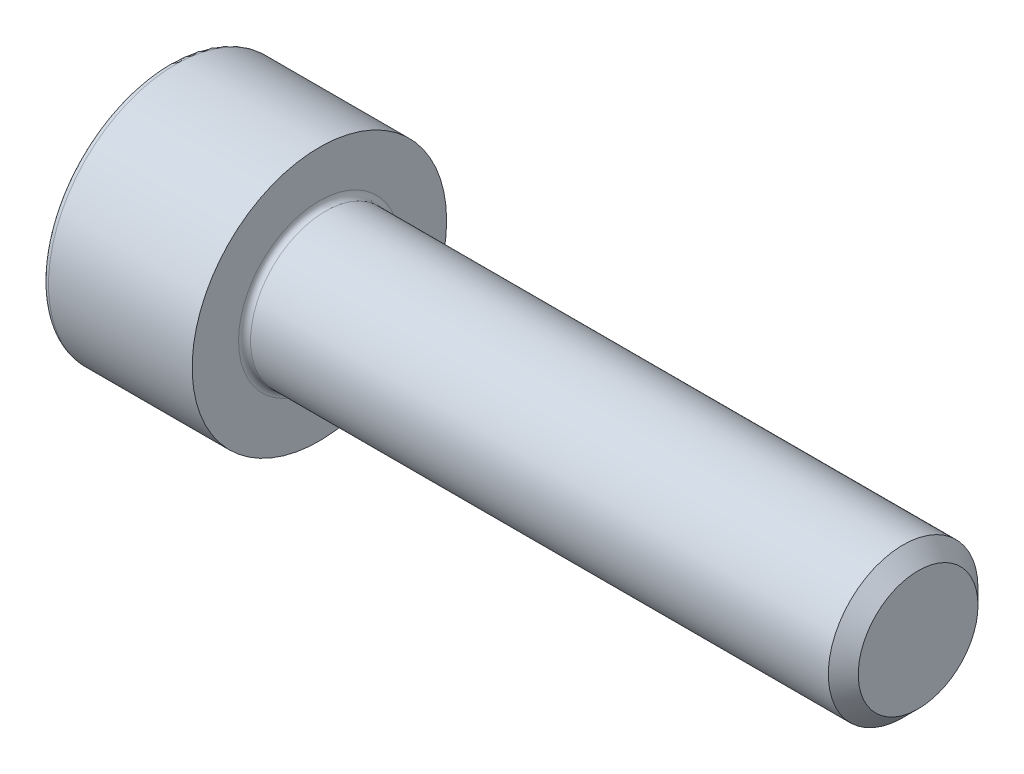
ISO-10303-21;
HEADER;
FILE_DESCRIPTION(('STEP AP214'),'2;1');
FILE_NAME('part.step','',(''),(''),'','','');
FILE_SCHEMA(('AUTOMOTIVE_DESIGN { 1 0 10303 214 1 1 1 1 }'));
ENDSEC;
DATA;
#1=APPLICATION_CONTEXT('core data for automotive mechanical design processes');
#2=APPLICATION_PROTOCOL_DEFINITION('international standard','automotive_design',2000,#1);
#3=PRODUCT_CONTEXT('',#1,'mechanical');
#4=PRODUCT('Part','Part','',(#3));
#5=PRODUCT_RELATED_PRODUCT_CATEGORY('part','',(#4));
#6=PRODUCT_DEFINITION_FORMATION('','',#4);
#7=PRODUCT_DEFINITION_CONTEXT('part definition',#1,'design');
#8=PRODUCT_DEFINITION('design','',#6,#7);
#9=PRODUCT_DEFINITION_SHAPE('','',#8);
#10=(LENGTH_UNIT() NAMED_UNIT(*) SI_UNIT(.MILLI.,.METRE.));
#11=(NAMED_UNIT(*) PLANE_ANGLE_UNIT() SI_UNIT($,.RADIAN.));
#12=(NAMED_UNIT(*) SI_UNIT($,.STERADIAN.) SOLID_ANGLE_UNIT());
#13=UNCERTAINTY_MEASURE_WITH_UNIT(LENGTH_MEASURE(1.E-05),#10,'distance_accuracy_value','');
#14=(GEOMETRIC_REPRESENTATION_CONTEXT(3) GLOBAL_UNCERTAINTY_ASSIGNED_CONTEXT((#13)) GLOBAL_UNIT_ASSIGNED_CONTEXT((#10,
#11,#12)) REPRESENTATION_CONTEXT('',''));
#15=CARTESIAN_POINT('',(0.,0.,0.));
#16=DIRECTION('',(0.,0.,1.));
#17=DIRECTION('',(1.,0.,0.));
#18=AXIS2_PLACEMENT_3D('',#15,#16,#17);
#19=CARTESIAN_POINT('',(0.,0.,0.));
#20=DIRECTION('',(1.,0.,0.));
#21=DIRECTION('',(0.,0.,-1.));
#22=AXIS2_PLACEMENT_3D('',#19,#20,#21);
#23=CYLINDRICAL_SURFACE('',#22,2.5);
#24=CARTESIAN_POINT('',(24.5,0.,0.));
#25=DIRECTION('',(1.,0.,0.));
#26=DIRECTION('',(0.,0.,-1.));
#27=AXIS2_PLACEMENT_3D('',#24,#25,#26);
#28=CIRCLE('',#27,2.5);
#29=CARTESIAN_POINT('',(24.5,0.,-2.5));
#30=VERTEX_POINT('',#29);
#31=EDGE_CURVE('E11',#30,#30,#28,.F.);
#32=ORIENTED_EDGE('',*,*,#31,.T.);
#33=EDGE_LOOP('',(#32));
#34=FACE_BOUND('',#33,.T.);
#35=CARTESIAN_POINT('',(5.2,0.,0.));
#36=DIRECTION('',(1.,0.,0.));
#37=DIRECTION('',(0.,0.,-1.));
#38=AXIS2_PLACEMENT_3D('',#35,#36,#37);
#39=CIRCLE('',#38,2.5);
#40=CARTESIAN_POINT('',(5.2,0.,-2.5));
#41=VERTEX_POINT('',#40);
#42=EDGE_CURVE('E161',#41,#41,#39,.T.);
#43=ORIENTED_EDGE('',*,*,#42,.T.);
#44=EDGE_LOOP('',(#43));
#45=FACE_BOUND('',#44,.T.);
#46=ADVANCED_FACE('F38',(#34,#45),#23,.T.);
#47=CARTESIAN_POINT('',(2.5,-1.145,1.98319817466636));
#48=DIRECTION('',(-1.,0.,0.));
#49=DIRECTION('',(0.,0.,1.));
#50=AXIS2_PLACEMENT_3D('',#47,#48,#49);
#51=PLANE('',#50);
#52=DIRECTION('',(0.,1.,0.));
#53=VECTOR('',#52,1.);
#54=CARTESIAN_POINT('',(2.5,1.145,-1.98319817466636));
#55=LINE('',#54,#53);
#56=CARTESIAN_POINT('',(2.5,1.145,-1.98319817466636));
#57=VERTEX_POINT('',#56);
#58=CARTESIAN_POINT('',(2.5,-1.145,-1.98319817466636));
#59=VERTEX_POINT('',#58);
#60=EDGE_CURVE('E100',#57,#59,#55,.F.);
#61=ORIENTED_EDGE('',*,*,#60,.T.);
#62=DIRECTION('',(0.,0.5,-0.866025403784439));
#63=VECTOR('',#62,1.);
#64=CARTESIAN_POINT('',(2.5,-1.145,-1.98319817466636));
#65=LINE('',#64,#63);
#66=CARTESIAN_POINT('',(2.5,-2.29,0.));
#67=VERTEX_POINT('',#66);
#68=EDGE_CURVE('E102',#59,#67,#65,.F.);
#69=ORIENTED_EDGE('',*,*,#68,.T.);
#70=DIRECTION('',(0.,-0.5,-0.866025403784439));
#71=VECTOR('',#70,1.);
#72=CARTESIAN_POINT('',(2.5,-2.29,0.));
#73=LINE('',#72,#71);
#74=CARTESIAN_POINT('',(2.5,-1.145,1.98319817466636));
#75=VERTEX_POINT('',#74);
#76=EDGE_CURVE('E105',#67,#75,#73,.F.);
#77=ORIENTED_EDGE('',*,*,#76,.T.);
#78=DIRECTION('',(0.,-1.,0.));
#79=VECTOR('',#78,1.);
#80=CARTESIAN_POINT('',(2.5,-1.145,1.98319817466636));
#81=LINE('',#80,#79);
#82=CARTESIAN_POINT('',(2.5,1.145,1.98319817466636));
#83=VERTEX_POINT('',#82);
#84=EDGE_CURVE('E365',#75,#83,#81,.F.);
#85=ORIENTED_EDGE('',*,*,#84,.T.);
#86=DIRECTION('',(0.,-0.5,0.866025403784439));
#87=VECTOR('',#86,1.);
#88=CARTESIAN_POINT('',(2.5,1.145,1.98319817466636));
#89=LINE('',#88,#87);
#90=CARTESIAN_POINT('',(2.5,2.29,0.));
#91=VERTEX_POINT('',#90);
#92=EDGE_CURVE('E360',#83,#91,#89,.F.);
#93=ORIENTED_EDGE('',*,*,#92,.T.);
#94=DIRECTION('',(0.,0.5,0.866025403784439));
#95=VECTOR('',#94,1.);
#96=CARTESIAN_POINT('',(2.5,2.29,0.));
#97=LINE('',#96,#95);
#98=EDGE_CURVE('E355',#91,#57,#97,.F.);
#99=ORIENTED_EDGE('',*,*,#98,.T.);
#100=EDGE_LOOP('',(#61,#69,#77,#85,#93,#99));
#101=FACE_BOUND('',#100,.T.);
#102=ADVANCED_FACE('F104',(#101),#51,.T.);
#103=CARTESIAN_POINT('',(2.5,-2.29,0.));
#104=DIRECTION('',(0.,-0.866025403784439,0.5));
#105=DIRECTION('',(0.,-0.5,-0.866025403784439));
#106=AXIS2_PLACEMENT_3D('',#103,#104,#105);
#107=PLANE('',#106);
#108=DIRECTION('',(1.,0.,0.));
#109=VECTOR('',#108,1.);
#110=CARTESIAN_POINT('',(2.5,-1.145,1.98319817466636));
#111=LINE('',#110,#109);
#112=CARTESIAN_POINT('',(0.,-1.145,1.98319817466636));
#113=VERTEX_POINT('',#112);
#114=EDGE_CURVE('E116',#113,#75,#111,.T.);
#115=ORIENTED_EDGE('',*,*,#114,.T.);
#116=ORIENTED_EDGE('',*,*,#76,.F.);
#117=DIRECTION('',(1.,0.,0.));
#118=VECTOR('',#117,1.);
#119=CARTESIAN_POINT('',(2.5,-2.29,0.));
#120=LINE('',#119,#118);
#121=CARTESIAN_POINT('',(0.,-2.29,0.));
#122=VERTEX_POINT('',#121);
#123=EDGE_CURVE('E110',#67,#122,#120,.F.);
#124=ORIENTED_EDGE('',*,*,#123,.T.);
#125=DIRECTION('',(0.,-0.5,-0.866025403784439));
#126=VECTOR('',#125,1.);
#127=CARTESIAN_POINT('',(0.,-1.145,1.98319817466636));
#128=LINE('',#127,#126);
#129=EDGE_CURVE('E367',#113,#122,#128,.T.);
#130=ORIENTED_EDGE('',*,*,#129,.F.);
#131=EDGE_LOOP('',(#115,#116,#124,#130));
#132=FACE_BOUND('',#131,.T.);
#133=ADVANCED_FACE('F113',(#132),#107,.F.);
#134=CARTESIAN_POINT('',(2.5,-1.145,-1.98319817466636));
#135=DIRECTION('',(0.,-0.866025403784439,-0.5));
#136=DIRECTION('',(0.,0.5,-0.866025403784439));
#137=AXIS2_PLACEMENT_3D('',#134,#135,#136);
#138=PLANE('',#137);
#139=ORIENTED_EDGE('',*,*,#123,.F.);
#140=ORIENTED_EDGE('',*,*,#68,.F.);
#141=DIRECTION('',(1.,0.,0.));
#142=VECTOR('',#141,1.);
#143=CARTESIAN_POINT('',(2.5,-1.145,-1.98319817466636));
#144=LINE('',#143,#142);
#145=CARTESIAN_POINT('',(0.,-1.145,-1.98319817466636));
#146=VERTEX_POINT('',#145);
#147=EDGE_CURVE('E124',#59,#146,#144,.F.);
#148=ORIENTED_EDGE('',*,*,#147,.T.);
#149=DIRECTION('',(0.,0.5,-0.866025403784439));
#150=VECTOR('',#149,1.);
#151=CARTESIAN_POINT('',(0.,-2.29,0.));
#152=LINE('',#151,#150);
#153=EDGE_CURVE('E121',#122,#146,#152,.T.);
#154=ORIENTED_EDGE('',*,*,#153,.F.);
#155=EDGE_LOOP('',(#139,#140,#148,#154));
#156=FACE_BOUND('',#155,.T.);
#157=ADVANCED_FACE('F119',(#156),#138,.F.);
#158=CARTESIAN_POINT('',(2.5,1.145,-1.98319817466636));
#159=DIRECTION('',(0.,0.,-1.));
#160=DIRECTION('',(0.,1.,0.));
#161=AXIS2_PLACEMENT_3D('',#158,#159,#160);
#162=PLANE('',#161);
#163=ORIENTED_EDGE('',*,*,#147,.F.);
#164=ORIENTED_EDGE('',*,*,#60,.F.);
#165=DIRECTION('',(1.,0.,0.));
#166=VECTOR('',#165,1.);
#167=CARTESIAN_POINT('',(2.5,1.145,-1.98319817466636));
#168=LINE('',#167,#166);
#169=CARTESIAN_POINT('',(0.,1.145,-1.98319817466636));
#170=VERTEX_POINT('',#169);
#171=EDGE_CURVE('E356',#57,#170,#168,.F.);
#172=ORIENTED_EDGE('',*,*,#171,.T.);
#173=DIRECTION('',(0.,1.,0.));
#174=VECTOR('',#173,1.);
#175=CARTESIAN_POINT('',(0.,0.,-1.98319817466636));
#176=LINE('',#175,#174);
#177=EDGE_CURVE('E354',#146,#170,#176,.T.);
#178=ORIENTED_EDGE('',*,*,#177,.F.);
#179=EDGE_LOOP('',(#163,#164,#172,#178));
#180=FACE_BOUND('',#179,.T.);
#181=ADVANCED_FACE('F292',(#180),#162,.F.);
#182=CARTESIAN_POINT('',(2.5,2.29,0.));
#183=DIRECTION('',(0.,0.866025403784439,-0.5));
#184=DIRECTION('',(0.,0.5,0.866025403784439));
#185=AXIS2_PLACEMENT_3D('',#182,#183,#184);
#186=PLANE('',#185);
#187=ORIENTED_EDGE('',*,*,#171,.F.);
#188=ORIENTED_EDGE('',*,*,#98,.F.);
#189=DIRECTION('',(1.,0.,0.));
#190=VECTOR('',#189,1.);
#191=CARTESIAN_POINT('',(2.5,2.29,0.));
#192=LINE('',#191,#190);
#193=CARTESIAN_POINT('',(0.,2.29,0.));
#194=VERTEX_POINT('',#193);
#195=EDGE_CURVE('E362',#91,#194,#192,.F.);
#196=ORIENTED_EDGE('',*,*,#195,.T.);
#197=DIRECTION('',(0.,0.5,0.866025403784439));
#198=VECTOR('',#197,1.);
#199=CARTESIAN_POINT('',(0.,1.145,-1.98319817466636));
#200=LINE('',#199,#198);
#201=EDGE_CURVE('E386',#170,#194,#200,.T.);
#202=ORIENTED_EDGE('',*,*,#201,.F.);
#203=EDGE_LOOP('',(#187,#188,#196,#202));
#204=FACE_BOUND('',#203,.T.);
#205=ADVANCED_FACE('F283',(#204),#186,.F.);
#206=CARTESIAN_POINT('',(2.5,1.145,1.98319817466636));
#207=DIRECTION('',(0.,0.866025403784439,0.5));
#208=DIRECTION('',(0.,-0.5,0.866025403784439));
#209=AXIS2_PLACEMENT_3D('',#206,#207,#208);
#210=PLANE('',#209);
#211=ORIENTED_EDGE('',*,*,#195,.F.);
#212=ORIENTED_EDGE('',*,*,#92,.F.);
#213=DIRECTION('',(1.,0.,0.));
#214=VECTOR('',#213,1.);
#215=CARTESIAN_POINT('',(2.5,1.145,1.98319817466636));
#216=LINE('',#215,#214);
#217=CARTESIAN_POINT('',(0.,1.145,1.98319817466636));
#218=VERTEX_POINT('',#217);
#219=EDGE_CURVE('E366',#83,#218,#216,.F.);
#220=ORIENTED_EDGE('',*,*,#219,.T.);
#221=DIRECTION('',(0.,-0.5,0.866025403784439));
#222=VECTOR('',#221,1.);
#223=CARTESIAN_POINT('',(0.,2.29,0.));
#224=LINE('',#223,#222);
#225=EDGE_CURVE('E383',#194,#218,#224,.T.);
#226=ORIENTED_EDGE('',*,*,#225,.F.);
#227=EDGE_LOOP('',(#211,#212,#220,#226));
#228=FACE_BOUND('',#227,.T.);
#229=ADVANCED_FACE('F276',(#228),#210,.F.);
#230=CARTESIAN_POINT('',(2.5,-1.145,1.98319817466636));
#231=DIRECTION('',(0.,0.,1.));
#232=DIRECTION('',(0.,-1.,0.));
#233=AXIS2_PLACEMENT_3D('',#230,#231,#232);
#234=PLANE('',#233);
#235=ORIENTED_EDGE('',*,*,#219,.F.);
#236=ORIENTED_EDGE('',*,*,#84,.F.);
#237=ORIENTED_EDGE('',*,*,#114,.F.);
#238=DIRECTION('',(0.,1.,0.));
#239=VECTOR('',#238,1.);
#240=CARTESIAN_POINT('',(0.,0.,1.98319817466636));
#241=LINE('',#240,#239);
#242=EDGE_CURVE('E382',#218,#113,#241,.F.);
#243=ORIENTED_EDGE('',*,*,#242,.F.);
#244=EDGE_LOOP('',(#235,#236,#237,#243));
#245=FACE_BOUND('',#244,.T.);
#246=ADVANCED_FACE('F269',(#245),#234,.F.);
#247=CARTESIAN_POINT('',(0.,0.,0.));
#248=DIRECTION('',(-1.,0.,0.));
#249=DIRECTION('',(0.,0.,1.));
#250=AXIS2_PLACEMENT_3D('',#247,#248,#249);
#251=PLANE('',#250);
#252=ORIENTED_EDGE('',*,*,#225,.T.);
#253=ORIENTED_EDGE('',*,*,#242,.T.);
#254=ORIENTED_EDGE('',*,*,#129,.T.);
#255=ORIENTED_EDGE('',*,*,#153,.T.);
#256=ORIENTED_EDGE('',*,*,#177,.T.);
#257=ORIENTED_EDGE('',*,*,#201,.T.);
#258=EDGE_LOOP('',(#252,#253,#254,#255,#256,#257));
#259=FACE_BOUND('',#258,.T.);
#260=CARTESIAN_POINT('',(0.,0.,0.));
#261=DIRECTION('',(1.,0.,0.));
#262=DIRECTION('',(0.,0.,-1.));
#263=AXIS2_PLACEMENT_3D('',#260,#261,#262);
#264=CIRCLE('',#263,4.05);
#265=CARTESIAN_POINT('',(0.,0.,-4.05));
#266=VERTEX_POINT('',#265);
#267=CARTESIAN_POINT('',(0.,0.,4.05));
#268=VERTEX_POINT('',#267);
#269=EDGE_CURVE('E379',#266,#268,#264,.T.);
#270=ORIENTED_EDGE('',*,*,#269,.F.);
#271=CARTESIAN_POINT('',(0.,0.,0.));
#272=DIRECTION('',(1.,0.,0.));
#273=DIRECTION('',(0.,0.,1.));
#274=AXIS2_PLACEMENT_3D('',#271,#272,#273);
#275=CIRCLE('',#274,4.05);
#276=EDGE_CURVE('E190',#268,#266,#275,.T.);
#277=ORIENTED_EDGE('',*,*,#276,.F.);
#278=EDGE_LOOP('',(#270,#277));
#279=FACE_BOUND('',#278,.T.);
#280=ADVANCED_FACE('F200',(#259,#279),#251,.T.);
#281=CARTESIAN_POINT('',(0.2,0.,0.));
#282=DIRECTION('',(-1.,0.,0.));
#283=DIRECTION('',(0.,0.,1.));
#284=AXIS2_PLACEMENT_3D('',#281,#282,#283);
#285=TOROIDAL_SURFACE('',#284,4.05,0.2);
#286=CARTESIAN_POINT('',(0.2,0.,0.));
#287=DIRECTION('',(1.,0.,0.));
#288=DIRECTION('',(0.,0.,-1.));
#289=AXIS2_PLACEMENT_3D('',#286,#287,#288);
#290=CIRCLE('',#289,4.25);
#291=CARTESIAN_POINT('',(0.2,0.,-4.25));
#292=VERTEX_POINT('',#291);
#293=EDGE_CURVE('E132',#292,#292,#290,.T.);
#294=ORIENTED_EDGE('',*,*,#293,.F.);
#295=EDGE_LOOP('',(#294));
#296=FACE_BOUND('',#295,.T.);
#297=ORIENTED_EDGE('',*,*,#276,.T.);
#298=ORIENTED_EDGE('',*,*,#269,.T.);
#299=EDGE_LOOP('',(#297,#298));
#300=FACE_BOUND('',#299,.T.);
#301=ADVANCED_FACE('F195',(#296,#300),#285,.T.);
#302=CARTESIAN_POINT('',(0.,0.,0.));
#303=DIRECTION('',(1.,0.,0.));
#304=DIRECTION('',(0.,0.,-1.));
#305=AXIS2_PLACEMENT_3D('',#302,#303,#304);
#306=CYLINDRICAL_SURFACE('',#305,4.25);
#307=ORIENTED_EDGE('',*,*,#293,.T.);
#308=EDGE_LOOP('',(#307));
#309=FACE_BOUND('',#308,.T.);
#310=CARTESIAN_POINT('',(5.,0.,0.));
#311=DIRECTION('',(1.,0.,0.));
#312=DIRECTION('',(0.,0.,-1.));
#313=AXIS2_PLACEMENT_3D('',#310,#311,#312);
#314=CIRCLE('',#313,4.25);
#315=CARTESIAN_POINT('',(5.,0.,-4.25));
#316=VERTEX_POINT('',#315);
#317=EDGE_CURVE('E128',#316,#316,#314,.T.);
#318=ORIENTED_EDGE('',*,*,#317,.F.);
#319=EDGE_LOOP('',(#318));
#320=FACE_BOUND('',#319,.T.);
#321=ADVANCED_FACE('F199',(#309,#320),#306,.T.);
#322=CARTESIAN_POINT('',(5.,4.25,0.));
#323=DIRECTION('',(1.,0.,0.));
#324=DIRECTION('',(0.,0.,-1.));
#325=AXIS2_PLACEMENT_3D('',#322,#323,#324);
#326=PLANE('',#325);
#327=CARTESIAN_POINT('',(5.,0.,0.));
#328=DIRECTION('',(1.,0.,0.));
#329=DIRECTION('',(0.,0.,-1.));
#330=AXIS2_PLACEMENT_3D('',#327,#328,#329);
#331=CIRCLE('',#330,2.7);
#332=CARTESIAN_POINT('',(5.,0.,2.7));
#333=VERTEX_POINT('',#332);
#334=CARTESIAN_POINT('',(5.,0.,-2.7));
#335=VERTEX_POINT('',#334);
#336=EDGE_CURVE('E55',#333,#335,#331,.F.);
#337=ORIENTED_EDGE('',*,*,#336,.T.);
#338=CARTESIAN_POINT('',(5.,0.,0.));
#339=DIRECTION('',(1.,0.,0.));
#340=DIRECTION('',(0.,0.,1.));
#341=AXIS2_PLACEMENT_3D('',#338,#339,#340);
#342=CIRCLE('',#341,2.7);
#343=EDGE_CURVE('E131',#335,#333,#342,.F.);
#344=ORIENTED_EDGE('',*,*,#343,.T.);
#345=EDGE_LOOP('',(#337,#344));
#346=FACE_BOUND('',#345,.T.);
#347=ORIENTED_EDGE('',*,*,#317,.T.);
#348=EDGE_LOOP('',(#347));
#349=FACE_BOUND('',#348,.T.);
#350=ADVANCED_FACE('F152',(#346,#349),#326,.T.);
#351=CARTESIAN_POINT('',(5.2,0.,0.));
#352=DIRECTION('',(1.,0.,0.));
#353=DIRECTION('',(0.,0.,-1.));
#354=AXIS2_PLACEMENT_3D('',#351,#352,#353);
#355=TOROIDAL_SURFACE('',#354,2.7,0.2);
#356=ORIENTED_EDGE('',*,*,#42,.F.);
#357=EDGE_LOOP('',(#356));
#358=FACE_BOUND('',#357,.T.);
#359=ORIENTED_EDGE('',*,*,#343,.F.);
#360=ORIENTED_EDGE('',*,*,#336,.F.);
#361=EDGE_LOOP('',(#359,#360));
#362=FACE_BOUND('',#361,.T.);
#363=ADVANCED_FACE('F140',(#358,#362),#355,.F.);
#364=CARTESIAN_POINT('',(25.,0.,0.));
#365=DIRECTION('',(1.,0.,0.));
#366=DIRECTION('',(0.,0.,-1.));
#367=AXIS2_PLACEMENT_3D('',#364,#365,#366);
#368=PLANE('',#367);
#369=CARTESIAN_POINT('',(25.,0.,0.));
#370=DIRECTION('',(1.,0.,0.));
#371=DIRECTION('',(0.,0.,-1.));
#372=AXIS2_PLACEMENT_3D('',#369,#370,#371);
#373=CIRCLE('',#372,2.);
#374=CARTESIAN_POINT('',(25.,0.,-2.));
#375=VERTEX_POINT('',#374);
#376=EDGE_CURVE('E48',#375,#375,#373,.T.);
#377=ORIENTED_EDGE('',*,*,#376,.T.);
#378=EDGE_LOOP('',(#377));
#379=FACE_BOUND('',#378,.T.);
#380=ADVANCED_FACE('F151',(#379),#368,.T.);
#381=CARTESIAN_POINT('',(25.,0.,0.));
#382=DIRECTION('',(-1.,0.,0.));
#383=DIRECTION('',(0.,0.,1.));
#384=AXIS2_PLACEMENT_3D('',#381,#382,#383);
#385=CONICAL_SURFACE('',#384,2.,0.785398163397447);
#386=ORIENTED_EDGE('',*,*,#31,.F.);
#387=EDGE_LOOP('',(#386));
#388=FACE_BOUND('',#387,.T.);
#389=ORIENTED_EDGE('',*,*,#376,.F.);
#390=EDGE_LOOP('',(#389));
#391=FACE_BOUND('',#390,.T.);
#392=ADVANCED_FACE('F41',(#388,#391),#385,.T.);
#393=CLOSED_SHELL('',(#46,#102,#133,#157,#181,#205,#229,#246,#280,#301,#321,#350,#363,#380,#392));
#394=MANIFOLD_SOLID_BREP('B2',#393);
#395=ADVANCED_BREP_SHAPE_REPRESENTATION('',(#18,#394),#14);
#396=SHAPE_DEFINITION_REPRESENTATION(#9,#395);
ENDSEC;
END-ISO-10303-21;
